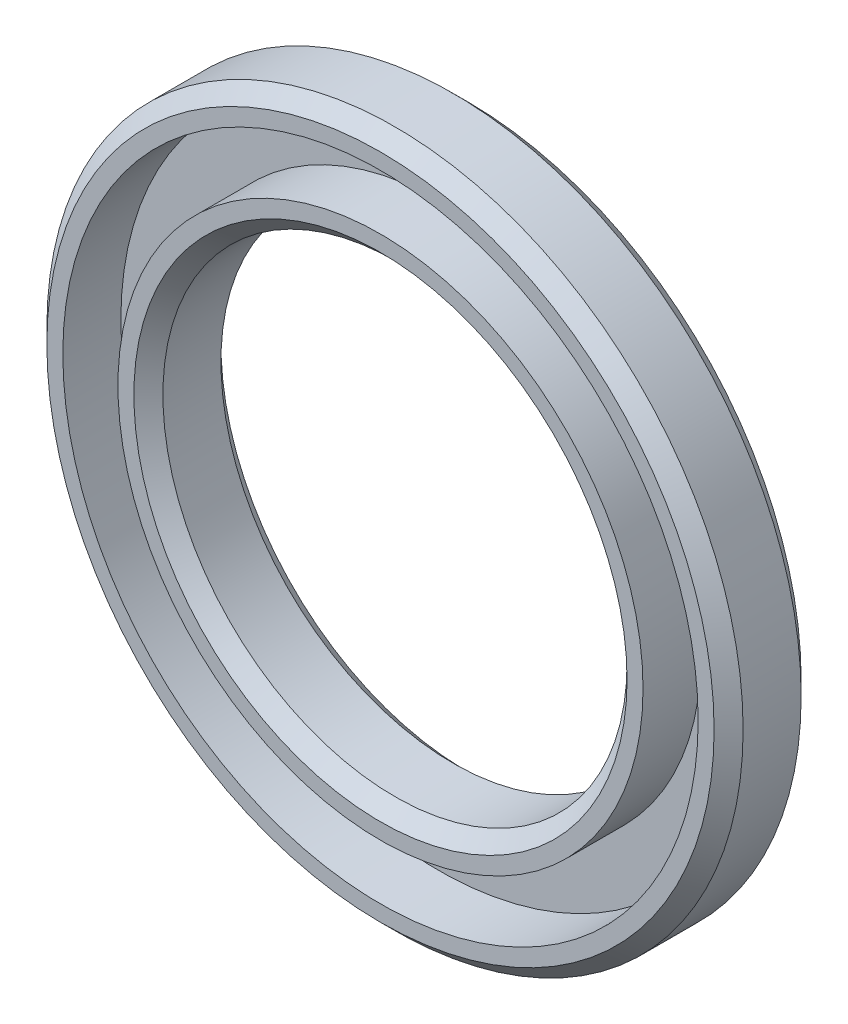
ISO-10303-21;
HEADER;
FILE_DESCRIPTION(('STEP AP214'),'2;1');
FILE_NAME('part.step','',(''),(''),'','','');
FILE_SCHEMA(('AUTOMOTIVE_DESIGN { 1 0 10303 214 1 1 1 1 }'));
ENDSEC;
DATA;
#1=APPLICATION_CONTEXT('core data for automotive mechanical design processes');
#2=APPLICATION_PROTOCOL_DEFINITION('international standard','automotive_design',2000,#1);
#3=PRODUCT_CONTEXT('',#1,'mechanical');
#4=PRODUCT('Part','Part','',(#3));
#5=PRODUCT_RELATED_PRODUCT_CATEGORY('part','',(#4));
#6=PRODUCT_DEFINITION_FORMATION('','',#4);
#7=PRODUCT_DEFINITION_CONTEXT('part definition',#1,'design');
#8=PRODUCT_DEFINITION('design','',#6,#7);
#9=PRODUCT_DEFINITION_SHAPE('','',#8);
#10=(LENGTH_UNIT() NAMED_UNIT(*) SI_UNIT(.MILLI.,.METRE.));
#11=(NAMED_UNIT(*) PLANE_ANGLE_UNIT() SI_UNIT($,.RADIAN.));
#12=(NAMED_UNIT(*) SI_UNIT($,.STERADIAN.) SOLID_ANGLE_UNIT());
#13=UNCERTAINTY_MEASURE_WITH_UNIT(LENGTH_MEASURE(1.E-05),#10,'distance_accuracy_value','');
#14=(GEOMETRIC_REPRESENTATION_CONTEXT(3) GLOBAL_UNCERTAINTY_ASSIGNED_CONTEXT((#13)) GLOBAL_UNIT_ASSIGNED_CONTEXT((#10,
#11,#12)) REPRESENTATION_CONTEXT('',''));
#15=CARTESIAN_POINT('',(0.,0.,0.));
#16=DIRECTION('',(0.,0.,1.));
#17=DIRECTION('',(1.,0.,0.));
#18=AXIS2_PLACEMENT_3D('',#15,#16,#17);
#19=CARTESIAN_POINT('',(0.,0.,3.));
#20=DIRECTION('',(0.,0.,1.));
#21=DIRECTION('',(1.,0.,0.));
#22=AXIS2_PLACEMENT_3D('',#19,#20,#21);
#23=PLANE('',#22);
#24=CARTESIAN_POINT('',(0.,0.,3.));
#25=DIRECTION('',(0.,0.,1.));
#26=DIRECTION('',(1.,0.,0.));
#27=AXIS2_PLACEMENT_3D('',#24,#25,#26);
#28=CIRCLE('',#27,8.5);
#29=CARTESIAN_POINT('',(8.5,0.,3.));
#30=VERTEX_POINT('',#29);
#31=EDGE_CURVE('E10',#30,#30,#28,.F.);
#32=ORIENTED_EDGE('',*,*,#31,.T.);
#33=EDGE_LOOP('',(#32));
#34=FACE_BOUND('',#33,.T.);
#35=CARTESIAN_POINT('',(0.,0.,3.));
#36=DIRECTION('',(0.,0.,1.));
#37=DIRECTION('',(1.,0.,0.));
#38=AXIS2_PLACEMENT_3D('',#35,#36,#37);
#39=CIRCLE('',#38,9.05);
#40=CARTESIAN_POINT('',(9.05,0.,3.));
#41=VERTEX_POINT('',#40);
#42=EDGE_CURVE('E72',#41,#41,#39,.T.);
#43=ORIENTED_EDGE('',*,*,#42,.T.);
#44=EDGE_LOOP('',(#43));
#45=FACE_BOUND('',#44,.T.);
#46=ADVANCED_FACE('F33',(#34,#45),#23,.T.);
#47=CARTESIAN_POINT('',(0.,0.,3.));
#48=DIRECTION('',(0.,0.,1.));
#49=DIRECTION('',(1.,0.,0.));
#50=AXIS2_PLACEMENT_3D('',#47,#48,#49);
#51=CIRCLE('',#50,10.95);
#52=CARTESIAN_POINT('',(10.95,0.,3.));
#53=VERTEX_POINT('',#52);
#54=EDGE_CURVE('E66',#53,#53,#51,.T.);
#55=ORIENTED_EDGE('',*,*,#54,.F.);
#56=EDGE_LOOP('',(#55));
#57=FACE_BOUND('',#56,.T.);
#58=CARTESIAN_POINT('',(0.,0.,3.));
#59=DIRECTION('',(0.,0.,1.));
#60=DIRECTION('',(1.,0.,0.));
#61=AXIS2_PLACEMENT_3D('',#58,#59,#60);
#62=CIRCLE('',#61,11.5);
#63=CARTESIAN_POINT('',(11.5,0.,3.));
#64=VERTEX_POINT('',#63);
#65=EDGE_CURVE('E40',#64,#64,#62,.T.);
#66=ORIENTED_EDGE('',*,*,#65,.T.);
#67=EDGE_LOOP('',(#66));
#68=FACE_BOUND('',#67,.T.);
#69=ADVANCED_FACE('F93',(#57,#68),#23,.T.);
#70=CARTESIAN_POINT('',(0.,0.,0.));
#71=DIRECTION('',(0.,0.,1.));
#72=DIRECTION('',(1.,0.,0.));
#73=AXIS2_PLACEMENT_3D('',#70,#71,#72);
#74=PLANE('',#73);
#75=CARTESIAN_POINT('',(0.,0.,0.));
#76=DIRECTION('',(0.,0.,1.));
#77=DIRECTION('',(1.,0.,0.));
#78=AXIS2_PLACEMENT_3D('',#75,#76,#77);
#79=CIRCLE('',#78,11.5);
#80=CARTESIAN_POINT('',(11.5,0.,0.));
#81=VERTEX_POINT('',#80);
#82=EDGE_CURVE('E53',#81,#81,#79,.F.);
#83=ORIENTED_EDGE('',*,*,#82,.T.);
#84=EDGE_LOOP('',(#83));
#85=FACE_BOUND('',#84,.T.);
#86=CARTESIAN_POINT('',(0.,0.,0.));
#87=DIRECTION('',(0.,0.,1.));
#88=DIRECTION('',(1.,0.,0.));
#89=AXIS2_PLACEMENT_3D('',#86,#87,#88);
#90=CIRCLE('',#89,8.5);
#91=CARTESIAN_POINT('',(8.5,0.,0.));
#92=VERTEX_POINT('',#91);
#93=EDGE_CURVE('E56',#92,#92,#90,.T.);
#94=ORIENTED_EDGE('',*,*,#93,.T.);
#95=EDGE_LOOP('',(#94));
#96=FACE_BOUND('',#95,.T.);
#97=ADVANCED_FACE('F95',(#85,#96),#74,.F.);
#98=CARTESIAN_POINT('',(0.,0.,3.));
#99=DIRECTION('',(0.,0.,-1.));
#100=DIRECTION('',(-1.,0.,0.));
#101=AXIS2_PLACEMENT_3D('',#98,#99,#100);
#102=CYLINDRICAL_SURFACE('',#101,12.);
#103=CARTESIAN_POINT('',(0.,0.,0.500000000000007));
#104=DIRECTION('',(0.,0.,1.));
#105=DIRECTION('',(1.,0.,0.));
#106=AXIS2_PLACEMENT_3D('',#103,#104,#105);
#107=CIRCLE('',#106,12.);
#108=CARTESIAN_POINT('',(12.,0.,0.500000000000007));
#109=VERTEX_POINT('',#108);
#110=EDGE_CURVE('E59',#109,#109,#107,.T.);
#111=ORIENTED_EDGE('',*,*,#110,.T.);
#112=EDGE_LOOP('',(#111));
#113=FACE_BOUND('',#112,.T.);
#114=CARTESIAN_POINT('',(0.,0.,2.5));
#115=DIRECTION('',(0.,0.,1.));
#116=DIRECTION('',(1.,0.,0.));
#117=AXIS2_PLACEMENT_3D('',#114,#115,#116);
#118=CIRCLE('',#117,12.);
#119=CARTESIAN_POINT('',(12.,0.,2.5));
#120=VERTEX_POINT('',#119);
#121=EDGE_CURVE('E62',#120,#120,#118,.F.);
#122=ORIENTED_EDGE('',*,*,#121,.T.);
#123=EDGE_LOOP('',(#122));
#124=FACE_BOUND('',#123,.T.);
#125=ADVANCED_FACE('F101',(#113,#124),#102,.T.);
#126=CARTESIAN_POINT('',(0.,0.,3.));
#127=DIRECTION('',(0.,0.,-1.));
#128=DIRECTION('',(-1.,0.,0.));
#129=AXIS2_PLACEMENT_3D('',#126,#127,#128);
#130=CYLINDRICAL_SURFACE('',#129,8.);
#131=CARTESIAN_POINT('',(0.,0.,0.500000000000002));
#132=DIRECTION('',(0.,0.,1.));
#133=DIRECTION('',(1.,0.,0.));
#134=AXIS2_PLACEMENT_3D('',#131,#132,#133);
#135=CIRCLE('',#134,8.);
#136=CARTESIAN_POINT('',(8.,0.,0.500000000000002));
#137=VERTEX_POINT('',#136);
#138=EDGE_CURVE('E44',#137,#137,#135,.F.);
#139=ORIENTED_EDGE('',*,*,#138,.T.);
#140=EDGE_LOOP('',(#139));
#141=FACE_BOUND('',#140,.T.);
#142=CARTESIAN_POINT('',(0.,0.,2.5));
#143=DIRECTION('',(0.,0.,1.));
#144=DIRECTION('',(1.,0.,0.));
#145=AXIS2_PLACEMENT_3D('',#142,#143,#144);
#146=CIRCLE('',#145,8.);
#147=CARTESIAN_POINT('',(8.,0.,2.5));
#148=VERTEX_POINT('',#147);
#149=EDGE_CURVE('E48',#148,#148,#146,.T.);
#150=ORIENTED_EDGE('',*,*,#149,.T.);
#151=EDGE_LOOP('',(#150));
#152=FACE_BOUND('',#151,.T.);
#153=ADVANCED_FACE('F105',(#141,#152),#130,.F.);
#154=CARTESIAN_POINT('',(0.,0.,0.500000000000007));
#155=DIRECTION('',(0.,0.,1.));
#156=DIRECTION('',(1.,0.,0.));
#157=AXIS2_PLACEMENT_3D('',#154,#155,#156);
#158=CONICAL_SURFACE('',#157,12.,0.785398163397448);
#159=ORIENTED_EDGE('',*,*,#82,.F.);
#160=EDGE_LOOP('',(#159));
#161=FACE_BOUND('',#160,.T.);
#162=ORIENTED_EDGE('',*,*,#110,.F.);
#163=EDGE_LOOP('',(#162));
#164=FACE_BOUND('',#163,.T.);
#165=ADVANCED_FACE('F110',(#161,#164),#158,.T.);
#166=CARTESIAN_POINT('',(0.,0.,0.));
#167=DIRECTION('',(0.,0.,-1.));
#168=DIRECTION('',(-1.,0.,0.));
#169=AXIS2_PLACEMENT_3D('',#166,#167,#168);
#170=CONICAL_SURFACE('',#169,8.5,0.785398163397447);
#171=ORIENTED_EDGE('',*,*,#138,.F.);
#172=EDGE_LOOP('',(#171));
#173=FACE_BOUND('',#172,.T.);
#174=ORIENTED_EDGE('',*,*,#93,.F.);
#175=EDGE_LOOP('',(#174));
#176=FACE_BOUND('',#175,.T.);
#177=ADVANCED_FACE('F113',(#173,#176),#170,.F.);
#178=CARTESIAN_POINT('',(0.,0.,2.5));
#179=DIRECTION('',(0.,0.,1.));
#180=DIRECTION('',(1.,0.,0.));
#181=AXIS2_PLACEMENT_3D('',#178,#179,#180);
#182=CONICAL_SURFACE('',#181,8.,0.785398163397453);
#183=ORIENTED_EDGE('',*,*,#31,.F.);
#184=EDGE_LOOP('',(#183));
#185=FACE_BOUND('',#184,.T.);
#186=ORIENTED_EDGE('',*,*,#149,.F.);
#187=EDGE_LOOP('',(#186));
#188=FACE_BOUND('',#187,.T.);
#189=ADVANCED_FACE('F116',(#185,#188),#182,.F.);
#190=CARTESIAN_POINT('',(0.,0.,3.));
#191=DIRECTION('',(0.,0.,-1.));
#192=DIRECTION('',(-1.,0.,0.));
#193=AXIS2_PLACEMENT_3D('',#190,#191,#192);
#194=CONICAL_SURFACE('',#193,11.5,0.785398163397448);
#195=ORIENTED_EDGE('',*,*,#121,.F.);
#196=EDGE_LOOP('',(#195));
#197=FACE_BOUND('',#196,.T.);
#198=ORIENTED_EDGE('',*,*,#65,.F.);
#199=EDGE_LOOP('',(#198));
#200=FACE_BOUND('',#199,.T.);
#201=ADVANCED_FACE('F35',(#197,#200),#194,.T.);
#202=CARTESIAN_POINT('',(0.,0.,1.));
#203=DIRECTION('',(0.,0.,1.));
#204=DIRECTION('',(1.,0.,0.));
#205=AXIS2_PLACEMENT_3D('',#202,#203,#204);
#206=CYLINDRICAL_SURFACE('',#205,10.95);
#207=CARTESIAN_POINT('',(0.,0.,1.));
#208=DIRECTION('',(0.,0.,1.));
#209=DIRECTION('',(1.,0.,0.));
#210=AXIS2_PLACEMENT_3D('',#207,#208,#209);
#211=CIRCLE('',#210,10.95);
#212=CARTESIAN_POINT('',(10.95,0.,1.));
#213=VERTEX_POINT('',#212);
#214=EDGE_CURVE('E65',#213,#213,#211,.T.);
#215=ORIENTED_EDGE('',*,*,#214,.F.);
#216=EDGE_LOOP('',(#215));
#217=FACE_BOUND('',#216,.T.);
#218=ORIENTED_EDGE('',*,*,#54,.T.);
#219=EDGE_LOOP('',(#218));
#220=FACE_BOUND('',#219,.T.);
#221=ADVANCED_FACE('F84',(#217,#220),#206,.F.);
#222=CARTESIAN_POINT('',(0.,0.,1.));
#223=DIRECTION('',(0.,0.,1.));
#224=DIRECTION('',(1.,0.,0.));
#225=AXIS2_PLACEMENT_3D('',#222,#223,#224);
#226=PLANE('',#225);
#227=CARTESIAN_POINT('',(0.,0.,1.));
#228=DIRECTION('',(0.,0.,1.));
#229=DIRECTION('',(1.,0.,0.));
#230=AXIS2_PLACEMENT_3D('',#227,#228,#229);
#231=CIRCLE('',#230,9.05);
#232=CARTESIAN_POINT('',(9.05,0.,1.));
#233=VERTEX_POINT('',#232);
#234=EDGE_CURVE('E69',#233,#233,#231,.T.);
#235=ORIENTED_EDGE('',*,*,#234,.F.);
#236=EDGE_LOOP('',(#235));
#237=FACE_BOUND('',#236,.T.);
#238=ORIENTED_EDGE('',*,*,#214,.T.);
#239=EDGE_LOOP('',(#238));
#240=FACE_BOUND('',#239,.T.);
#241=ADVANCED_FACE('F81',(#237,#240),#226,.T.);
#242=CARTESIAN_POINT('',(0.,0.,1.));
#243=DIRECTION('',(0.,0.,1.));
#244=DIRECTION('',(1.,0.,0.));
#245=AXIS2_PLACEMENT_3D('',#242,#243,#244);
#246=CYLINDRICAL_SURFACE('',#245,9.05);
#247=ORIENTED_EDGE('',*,*,#234,.T.);
#248=EDGE_LOOP('',(#247));
#249=FACE_BOUND('',#248,.T.);
#250=ORIENTED_EDGE('',*,*,#42,.F.);
#251=EDGE_LOOP('',(#250));
#252=FACE_BOUND('',#251,.T.);
#253=ADVANCED_FACE('F78',(#249,#252),#246,.T.);
#254=CLOSED_SHELL('',(#46,#69,#97,#125,#153,#165,#177,#189,#201,#221,#241,#253));
#255=MANIFOLD_SOLID_BREP('B2',#254);
#256=ADVANCED_BREP_SHAPE_REPRESENTATION('',(#18,#255),#14);
#257=SHAPE_DEFINITION_REPRESENTATION(#9,#256);
ENDSEC;
END-ISO-10303-21;
